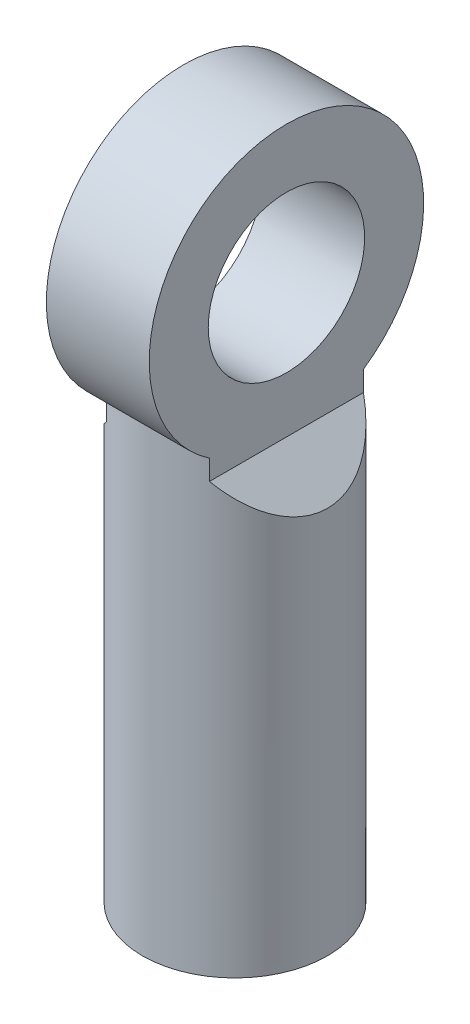
ISO-10303-21;
HEADER;
FILE_DESCRIPTION(('STEP AP214'),'2;1');
FILE_NAME('part.step','',(''),(''),'','','');
FILE_SCHEMA(('AUTOMOTIVE_DESIGN { 1 0 10303 214 1 1 1 1 }'));
ENDSEC;
DATA;
#1=APPLICATION_CONTEXT('core data for automotive mechanical design processes');
#2=APPLICATION_PROTOCOL_DEFINITION('international standard','automotive_design',2000,#1);
#3=PRODUCT_CONTEXT('',#1,'mechanical');
#4=PRODUCT('Part','Part','',(#3));
#5=PRODUCT_RELATED_PRODUCT_CATEGORY('part','',(#4));
#6=PRODUCT_DEFINITION_FORMATION('','',#4);
#7=PRODUCT_DEFINITION_CONTEXT('part definition',#1,'design');
#8=PRODUCT_DEFINITION('design','',#6,#7);
#9=PRODUCT_DEFINITION_SHAPE('','',#8);
#10=(LENGTH_UNIT() NAMED_UNIT(*) SI_UNIT(.MILLI.,.METRE.));
#11=(NAMED_UNIT(*) PLANE_ANGLE_UNIT() SI_UNIT($,.RADIAN.));
#12=(NAMED_UNIT(*) SI_UNIT($,.STERADIAN.) SOLID_ANGLE_UNIT());
#13=UNCERTAINTY_MEASURE_WITH_UNIT(LENGTH_MEASURE(1.E-05),#10,'distance_accuracy_value','');
#14=(GEOMETRIC_REPRESENTATION_CONTEXT(3) GLOBAL_UNCERTAINTY_ASSIGNED_CONTEXT((#13)) GLOBAL_UNIT_ASSIGNED_CONTEXT((#10,
#11,#12)) REPRESENTATION_CONTEXT('',''));
#15=CARTESIAN_POINT('',(0.,0.,0.));
#16=DIRECTION('',(0.,0.,1.));
#17=DIRECTION('',(1.,0.,0.));
#18=AXIS2_PLACEMENT_3D('',#15,#16,#17);
#19=CARTESIAN_POINT('',(0.,24.384,0.));
#20=DIRECTION('',(0.,-1.,0.));
#21=DIRECTION('',(0.,0.,-1.));
#22=AXIS2_PLACEMENT_3D('',#19,#20,#21);
#23=CYLINDRICAL_SURFACE('',#22,3.429);
#24=CARTESIAN_POINT('',(0.,0.,0.));
#25=DIRECTION('',(0.,1.,0.));
#26=DIRECTION('',(0.,0.,1.));
#27=AXIS2_PLACEMENT_3D('',#24,#25,#26);
#28=CIRCLE('',#27,3.429);
#29=CARTESIAN_POINT('',(0.,0.,3.429));
#30=VERTEX_POINT('',#29);
#31=EDGE_CURVE('E136',#30,#30,#28,.T.);
#32=ORIENTED_EDGE('',*,*,#31,.T.);
#33=EDGE_LOOP('',(#32));
#34=FACE_BOUND('',#33,.T.);
#35=CARTESIAN_POINT('',(0.,17.0798859409031,-3.429));
#36=CARTESIAN_POINT('',(-0.0833685074832233,17.0798858060849,-3.42899998442887));
#37=CARTESIAN_POINT('',(-0.166741147940647,17.0770918340976,-3.42595336744427));
#38=CARTESIAN_POINT('',(-0.332684930631039,17.0660616736041,-3.41383738905543));
#39=CARTESIAN_POINT('',(-0.41525597360773,17.0578248196494,-3.40476729121756));
#40=CARTESIAN_POINT('',(-0.578981594197905,17.0363007879698,-3.38078026733486));
#41=CARTESIAN_POINT('',(-0.660134166691902,17.0230069842865,-3.3658556695229));
#42=CARTESIAN_POINT('',(-0.820359272814698,16.991965806128,-3.33043458594731));
#43=CARTESIAN_POINT('',(-0.899430706409005,16.9742161266307,-3.30993521589847));
#44=CARTESIAN_POINT('',(-1.13119821787466,16.9157365593828,-3.24101815037118));
#45=CARTESIAN_POINT('',(-1.28028424948475,16.8695070512019,-3.18490130614518));
#46=CARTESIAN_POINT('',(-1.56656693814464,16.7678897254098,-3.05429754784925));
#47=CARTESIAN_POINT('',(-1.70376149121341,16.7125002921372,-2.97980739188551));
#48=CARTESIAN_POINT('',(-1.98656726351258,16.5881656716799,-2.80069896693761));
#49=CARTESIAN_POINT('',(-2.13000314419142,16.5184706905612,-2.69316541361507));
#50=CARTESIAN_POINT('',(-2.39876539808643,16.3794941116549,-2.45682676821383));
#51=CARTESIAN_POINT('',(-2.52407142019764,16.3102130608402,-2.32799811410505));
#52=CARTESIAN_POINT('',(-2.7053359293217,16.2058470030963,-2.10949139861423));
#53=CARTESIAN_POINT('',(-2.76816040459175,16.1687248283845,-2.02639343446406));
#54=CARTESIAN_POINT('',(-2.88648660028624,16.0974685306546,-1.85395851542749));
#55=CARTESIAN_POINT('',(-2.94199157782492,16.0633330808604,-1.76462436284229));
#56=CARTESIAN_POINT('',(-3.04500275888648,15.9990473111332,-1.58023181389675));
#57=CARTESIAN_POINT('',(-3.09251841605927,15.9688922904316,-1.48518036623931));
#58=CARTESIAN_POINT('',(-3.17891853531626,15.9134514115114,-1.28993090320555));
#59=CARTESIAN_POINT('',(-3.21780640252334,15.8881636328661,-1.18973493750707));
#60=CARTESIAN_POINT('',(-3.30312306572156,15.8322548323188,-0.934511183730478));
#61=CARTESIAN_POINT('',(-3.34386487108065,15.8051207918234,-0.776736878514408));
#62=CARTESIAN_POINT('',(-3.40256115342979,15.76585565311,-0.455293928646331));
#63=CARTESIAN_POINT('',(-3.42053298174522,15.7537131311385,-0.291629870071383));
#64=CARTESIAN_POINT('',(-3.43274879404838,15.7454710740521,0.0372818258191978));
#65=CARTESIAN_POINT('',(-3.42695369747785,15.7493979622532,0.202531625226222));
#66=CARTESIAN_POINT('',(-3.39187898771061,15.7729987697789,0.529373303551176));
#67=CARTESIAN_POINT('',(-3.36259244294595,15.792677336912,0.69096408833959));
#68=CARTESIAN_POINT('',(-3.28282675810848,15.845586797706,1.00331301879068));
#69=CARTESIAN_POINT('',(-3.23272824654401,15.8785739933011,1.15421143211392));
#70=CARTESIAN_POINT('',(-3.11353793865218,15.9555865407503,1.44522495242352));
#71=CARTESIAN_POINT('',(-3.04444254527492,15.9996139829305,1.58533801077078));
#72=CARTESIAN_POINT('',(-2.8807098918509,16.1012399032085,1.86792691186462));
#73=CARTESIAN_POINT('',(-2.78407139867111,16.1598087288367,2.00888864564534));
#74=CARTESIAN_POINT('',(-2.57248621709049,16.2828235106747,2.27357029874929));
#75=CARTESIAN_POINT('',(-2.45751816665401,16.347276286359,2.39726978052882));
#76=CARTESIAN_POINT('',(-2.19052957182794,16.4884370752746,2.64540976519641));
#77=CARTESIAN_POINT('',(-2.03552789422261,16.565392230355,2.76651559657206));
#78=CARTESIAN_POINT('',(-1.70495689880312,16.7129790804495,2.98160910335613));
#79=CARTESIAN_POINT('',(-1.52939993872615,16.7836145302317,3.07561295582998));
#80=CARTESIAN_POINT('',(-1.20357742299947,16.8936104548705,3.21448191422285));
#81=CARTESIAN_POINT('',(-1.05720679705724,16.936414489573,3.26571500031337));
#82=CARTESIAN_POINT('',(-0.75563721008462,17.0072681540424,3.3483428220456));
#83=CARTESIAN_POINT('',(-0.60045484442543,17.0353445620373,3.37977358396616));
#84=CARTESIAN_POINT('',(-0.283604759150127,17.0724770094032,3.42100603216829));
#85=CARTESIAN_POINT('',(-0.121895568420713,17.0813814129329,3.43063531607674));
#86=CARTESIAN_POINT('',(0.201040572868871,17.0779726749585,3.42690798076458));
#87=CARTESIAN_POINT('',(0.362267490918211,17.0656581339605,3.41354984541058));
#88=CARTESIAN_POINT('',(0.661425823499576,17.0245550527129,3.36763730457841));
#89=CARTESIAN_POINT('',(0.799989663400524,16.9976942009183,3.33731751390665));
#90=CARTESIAN_POINT('',(1.06982903586948,16.9323975732253,3.26085966449098));
#91=CARTESIAN_POINT('',(1.20109785797982,16.8939513424115,3.21470731284692));
#92=CARTESIAN_POINT('',(1.51190992006733,16.7901660207657,3.08414836618109));
#93=CARTESIAN_POINT('',(1.68670585418811,16.720498302888,2.99186809236919));
#94=CARTESIAN_POINT('',(2.01630572463553,16.5745370052542,2.78046848511011));
#95=CARTESIAN_POINT('',(2.17107219339015,16.4982314418449,2.66129996399573));
#96=CARTESIAN_POINT('',(2.46059122889498,16.3460864993438,2.39635401561446));
#97=CARTESIAN_POINT('',(2.59505305974586,16.2702665267581,2.25024651796202));
#98=CARTESIAN_POINT('',(2.83827500687003,16.127521452303,1.93438135820587));
#99=CARTESIAN_POINT('',(2.94707613487195,16.0605822328982,1.76466213298471));
#100=CARTESIAN_POINT('',(3.11801981979161,15.9528743424748,1.43660178981901));
#101=CARTESIAN_POINT('',(3.18502370979182,15.909567229578,1.28163371246739));
#102=CARTESIAN_POINT('',(3.29608398173576,15.8369326354213,0.960554317489945));
#103=CARTESIAN_POINT('',(3.34015513723274,15.8075961551417,0.794450251866528));
#104=CARTESIAN_POINT('',(3.40313804173787,15.765475756307,0.454614018057552));
#105=CARTESIAN_POINT('',(3.42193244876895,15.7527690452309,0.280850114149151));
#106=CARTESIAN_POINT('',(3.43276023807727,15.7454630979483,-0.067889609537704));
#107=CARTESIAN_POINT('',(3.42479841240746,15.7508606192657,-0.242865206699841));
#108=CARTESIAN_POINT('',(3.3843166840183,15.7780726547744,-0.574625769290895));
#109=CARTESIAN_POINT('',(3.35375617179691,15.7985768682977,-0.731766663182168));
#110=CARTESIAN_POINT('',(3.27192362853354,15.8527707730477,-1.03812914984899));
#111=CARTESIAN_POINT('',(3.22064828927559,15.8864625703416,-1.18734947337862));
#112=CARTESIAN_POINT('',(3.09625821890261,15.9666430902823,-1.48265569724507));
#113=CARTESIAN_POINT('',(3.02212246280541,16.0137196657838,-1.62814752354157));
#114=CARTESIAN_POINT('',(2.85570429918948,16.1164059152281,-1.90502620477143));
#115=CARTESIAN_POINT('',(2.76341183948118,16.1720203122457,-2.03640518376082));
#116=CARTESIAN_POINT('',(2.54689582107363,16.2974337442574,-2.30334543038858));
#117=CARTESIAN_POINT('',(2.41993070405486,16.3680850587929,-2.43628186906184));
#118=CARTESIAN_POINT('',(2.14666448950547,16.510259923123,-2.68019860069472));
#119=CARTESIAN_POINT('',(2.00034734582436,16.5817841515455,-2.79116048019197));
#120=CARTESIAN_POINT('',(1.69883821430654,16.7149488399295,-2.98363856337612));
#121=CARTESIAN_POINT('',(1.54464764830292,16.7769216077398,-3.06648578513813));
#122=CARTESIAN_POINT('',(1.22178629606702,16.8886721188634,-3.20878373221549));
#123=CARTESIAN_POINT('',(1.05314132600014,16.9384710165259,-3.26827515317422));
#124=CARTESIAN_POINT('',(0.737516292075622,17.0104691146867,-3.35191665259587));
#125=CARTESIAN_POINT('',(0.592582959440336,17.0361295932378,-3.38065611565295));
#126=CARTESIAN_POINT('',(0.371995624235096,17.0621849962633,-3.40957239162504));
#127=CARTESIAN_POINT('',(0.297937736677733,17.0687975653391,-3.41684565809843));
#128=CARTESIAN_POINT('',(0.149254213105864,17.0776474120702,-3.42655871149062));
#129=CARTESIAN_POINT('',(0.0746287624796964,17.0798860615879,-3.42900001393876));
#130=CARTESIAN_POINT('',(0.,17.0798859409031,-3.429));
#131=B_SPLINE_CURVE_WITH_KNOTS('',3,(#35,#36,#37,#38,#39,#40,#41,#42,#43,#44,#45,#46,#47,#48,
#49,#50,#51,#52,#53,#54,#55,#56,#57,#58,#59,#60,#61,#62,#63,#64,#65,#66,#67,#68,#69,#70,#71,#72,
#73,#74,#75,#76,#77,#78,#79,#80,#81,#82,#83,#84,#85,#86,#87,#88,#89,#90,#91,#92,#93,#94,#95,#96,
#97,#98,#99,#100,#101,#102,#103,#104,#105,#106,#107,#108,#109,#110,#111,#112,#113,#114,#115,
#116,#117,#118,#119,#120,#121,#122,#123,#124,#125,#126,#127,#128,#129,#130),.UNSPECIFIED.,.T.,
.F.,(4,2,2,2,2,2,2,2,2,2,2,2,2,2,2,2,2,2,2,2,2,2,2,2,2,2,2,2,2,2,2,2,2,2,2,2,2,2,2,2,2,2,2,2,2,
2,2,4),(0.,0.250011985609109,0.500054543430601,0.750425858790674,1.00092695894962,
1.49636986526057,1.99190025300909,2.56685254933574,3.14244531476325,3.47382548802032,
3.80505769870576,4.13589516580699,4.46660182835838,4.95984141267564,5.45270490886314,
5.94637915767233,6.44019912742249,6.9253597099025,7.41061222063464,7.95056561139307,
8.49115294950772,9.12213244288562,9.75273452359684,10.2335780701214,10.7135442746978,
11.1972929076302,11.6810734473876,12.1124828360356,12.5442827103955,13.169703572181,
13.7962779513696,14.4311123444653,15.0649251439232,15.5856487828732,16.1060365485654,
16.6288318610179,17.1515335455927,17.6335572780868,18.1156580215733,18.6235328893288,
19.1316897297966,19.7202154192051,20.3092321930495,20.8642121648209,21.4182207896799,
21.8659953215376,22.0898681059385,22.3136706622557),.UNSPECIFIED.);
#132=CARTESIAN_POINT('',(-1.905,16.6235518792593,2.85114292872174));
#133=VERTEX_POINT('',#132);
#134=CARTESIAN_POINT('',(1.905,16.6235518792593,2.85114292872174));
#135=VERTEX_POINT('',#134);
#136=EDGE_CURVE('E102',#133,#135,#131,.T.);
#137=ORIENTED_EDGE('',*,*,#136,.F.);
#138=DIRECTION('',(0.,-1.,0.));
#139=VECTOR('',#138,1.);
#140=CARTESIAN_POINT('',(-1.905,24.384,2.85114292872174));
#141=LINE('',#140,#139);
#142=CARTESIAN_POINT('',(-1.905,15.875,2.85114292872174));
#143=VERTEX_POINT('',#142);
#144=EDGE_CURVE('E137',#133,#143,#141,.T.);
#145=ORIENTED_EDGE('',*,*,#144,.T.);
#146=CARTESIAN_POINT('',(0.,17.78,0.));
#147=DIRECTION('',(0.707106781186551,-0.707106781186544,0.));
#148=DIRECTION('',(-0.707106781186544,-0.707106781186551,0.));
#149=AXIS2_PLACEMENT_3D('',#146,#147,#148);
#150=ELLIPSE('',#149,4.84933830537737,3.429);
#151=CARTESIAN_POINT('',(-1.905,15.875,-2.85114292872174));
#152=VERTEX_POINT('',#151);
#153=EDGE_CURVE('E40',#143,#152,#150,.T.);
#154=ORIENTED_EDGE('',*,*,#153,.T.);
#155=DIRECTION('',(0.,-1.,0.));
#156=VECTOR('',#155,1.);
#157=CARTESIAN_POINT('',(-1.905,24.384,-2.85114292872174));
#158=LINE('',#157,#156);
#159=CARTESIAN_POINT('',(-1.905,16.6235518792593,-2.85114292872174));
#160=VERTEX_POINT('',#159);
#161=EDGE_CURVE('E52',#152,#160,#158,.F.);
#162=ORIENTED_EDGE('',*,*,#161,.T.);
#163=CARTESIAN_POINT('',(1.905,16.6235518792593,-2.85114292872174));
#164=VERTEX_POINT('',#163);
#165=EDGE_CURVE('E96',#164,#160,#131,.T.);
#166=ORIENTED_EDGE('',*,*,#165,.F.);
#167=DIRECTION('',(0.,-1.,0.));
#168=VECTOR('',#167,1.);
#169=CARTESIAN_POINT('',(1.905,24.384,-2.85114292872174));
#170=LINE('',#169,#168);
#171=CARTESIAN_POINT('',(1.905,15.875,-2.85114292872174));
#172=VERTEX_POINT('',#171);
#173=EDGE_CURVE('E144',#164,#172,#170,.T.);
#174=ORIENTED_EDGE('',*,*,#173,.T.);
#175=CARTESIAN_POINT('',(0.,17.78,0.));
#176=DIRECTION('',(-0.707106781186551,-0.707106781186544,0.));
#177=DIRECTION('',(0.707106781186544,-0.707106781186551,0.));
#178=AXIS2_PLACEMENT_3D('',#175,#176,#177);
#179=ELLIPSE('',#178,4.84933830537737,3.429);
#180=CARTESIAN_POINT('',(1.905,15.875,2.85114292872174));
#181=VERTEX_POINT('',#180);
#182=EDGE_CURVE('E11',#172,#181,#179,.T.);
#183=ORIENTED_EDGE('',*,*,#182,.T.);
#184=DIRECTION('',(0.,-1.,0.));
#185=VECTOR('',#184,1.);
#186=CARTESIAN_POINT('',(1.905,24.384,2.85114292872174));
#187=LINE('',#186,#185);
#188=EDGE_CURVE('E145',#181,#135,#187,.F.);
#189=ORIENTED_EDGE('',*,*,#188,.T.);
#190=EDGE_LOOP('',(#137,#145,#154,#162,#166,#174,#183,#189));
#191=FACE_BOUND('',#190,.T.);
#192=ADVANCED_FACE('F32',(#34,#191),#23,.T.);
#193=CARTESIAN_POINT('',(0.,0.,0.));
#194=DIRECTION('',(0.,1.,0.));
#195=DIRECTION('',(0.,0.,1.));
#196=AXIS2_PLACEMENT_3D('',#193,#194,#195);
#197=PLANE('',#196);
#198=CARTESIAN_POINT('',(0.,0.,0.));
#199=DIRECTION('',(0.,-1.,0.));
#200=DIRECTION('',(0.,0.,-1.));
#201=AXIS2_PLACEMENT_3D('',#198,#199,#200);
#202=CIRCLE('',#201,2.49999999999999);
#203=CARTESIAN_POINT('',(0.,0.,-2.49999999999999));
#204=VERTEX_POINT('',#203);
#205=EDGE_CURVE('E85',#204,#204,#202,.T.);
#206=ORIENTED_EDGE('',*,*,#205,.F.);
#207=EDGE_LOOP('',(#206));
#208=FACE_BOUND('',#207,.T.);
#209=ORIENTED_EDGE('',*,*,#31,.F.);
#210=EDGE_LOOP('',(#209));
#211=FACE_BOUND('',#210,.T.);
#212=ADVANCED_FACE('F124',(#208,#211),#197,.F.);
#213=CARTESIAN_POINT('',(-1.905,15.875,-3.429));
#214=DIRECTION('',(0.707106781186551,-0.707106781186544,0.));
#215=DIRECTION('',(0.707106781186544,0.707106781186551,0.));
#216=AXIS2_PLACEMENT_3D('',#213,#214,#215);
#217=PLANE('',#216);
#218=DIRECTION('',(0.,0.,1.));
#219=VECTOR('',#218,1.);
#220=CARTESIAN_POINT('',(-1.905,15.875,-3.429));
#221=LINE('',#220,#219);
#222=EDGE_CURVE('E47',#152,#143,#221,.T.);
#223=ORIENTED_EDGE('',*,*,#222,.F.);
#224=ORIENTED_EDGE('',*,*,#153,.F.);
#225=EDGE_LOOP('',(#223,#224));
#226=FACE_BOUND('',#225,.T.);
#227=ADVANCED_FACE('F121',(#226),#217,.F.);
#228=CARTESIAN_POINT('',(-1.905,15.875,-3.429));
#229=DIRECTION('',(1.,0.,0.));
#230=DIRECTION('',(0.,0.,-1.));
#231=AXIS2_PLACEMENT_3D('',#228,#229,#230);
#232=PLANE('',#231);
#233=CARTESIAN_POINT('',(-1.905,20.828,0.));
#234=DIRECTION('',(-1.,0.,0.));
#235=DIRECTION('',(0.,0.,1.));
#236=AXIS2_PLACEMENT_3D('',#233,#234,#235);
#237=CIRCLE('',#236,2.8956);
#238=CARTESIAN_POINT('',(-1.905,20.828,2.8956));
#239=VERTEX_POINT('',#238);
#240=EDGE_CURVE('E169',#239,#239,#237,.T.);
#241=ORIENTED_EDGE('',*,*,#240,.F.);
#242=EDGE_LOOP('',(#241));
#243=FACE_BOUND('',#242,.T.);
#244=ORIENTED_EDGE('',*,*,#144,.F.);
#245=CARTESIAN_POINT('',(-1.905,20.828,0.));
#246=DIRECTION('',(1.,0.,0.));
#247=DIRECTION('',(0.,0.,-1.));
#248=AXIS2_PLACEMENT_3D('',#245,#246,#247);
#249=CIRCLE('',#248,5.08);
#250=EDGE_CURVE('E88',#160,#133,#249,.T.);
#251=ORIENTED_EDGE('',*,*,#250,.F.);
#252=ORIENTED_EDGE('',*,*,#161,.F.);
#253=ORIENTED_EDGE('',*,*,#222,.T.);
#254=EDGE_LOOP('',(#244,#251,#252,#253));
#255=FACE_BOUND('',#254,.T.);
#256=ADVANCED_FACE('F114',(#243,#255),#232,.F.);
#257=CARTESIAN_POINT('',(1.905,15.875,-3.429));
#258=DIRECTION('',(-0.707106781186551,-0.707106781186544,0.));
#259=DIRECTION('',(0.707106781186544,-0.707106781186551,0.));
#260=AXIS2_PLACEMENT_3D('',#257,#258,#259);
#261=PLANE('',#260);
#262=DIRECTION('',(0.,0.,1.));
#263=VECTOR('',#262,1.);
#264=CARTESIAN_POINT('',(1.905,15.875,-3.429));
#265=LINE('',#264,#263);
#266=EDGE_CURVE('E103',#172,#181,#265,.T.);
#267=ORIENTED_EDGE('',*,*,#266,.T.);
#268=ORIENTED_EDGE('',*,*,#182,.F.);
#269=EDGE_LOOP('',(#267,#268));
#270=FACE_BOUND('',#269,.T.);
#271=ADVANCED_FACE('F111',(#270),#261,.F.);
#272=CARTESIAN_POINT('',(1.905,15.875,-3.429));
#273=DIRECTION('',(-1.,0.,0.));
#274=DIRECTION('',(0.,0.,1.));
#275=AXIS2_PLACEMENT_3D('',#272,#273,#274);
#276=PLANE('',#275);
#277=CARTESIAN_POINT('',(1.905,20.828,0.));
#278=DIRECTION('',(-1.,0.,0.));
#279=DIRECTION('',(0.,0.,1.));
#280=AXIS2_PLACEMENT_3D('',#277,#278,#279);
#281=CIRCLE('',#280,2.8956);
#282=CARTESIAN_POINT('',(1.905,20.828,2.8956));
#283=VERTEX_POINT('',#282);
#284=EDGE_CURVE('E91',#283,#283,#281,.T.);
#285=ORIENTED_EDGE('',*,*,#284,.T.);
#286=EDGE_LOOP('',(#285));
#287=FACE_BOUND('',#286,.T.);
#288=ORIENTED_EDGE('',*,*,#173,.F.);
#289=CARTESIAN_POINT('',(1.905,20.828,0.));
#290=DIRECTION('',(-1.,0.,0.));
#291=DIRECTION('',(0.,0.,1.));
#292=AXIS2_PLACEMENT_3D('',#289,#290,#291);
#293=CIRCLE('',#292,5.08);
#294=EDGE_CURVE('E84',#164,#135,#293,.F.);
#295=ORIENTED_EDGE('',*,*,#294,.T.);
#296=ORIENTED_EDGE('',*,*,#188,.F.);
#297=ORIENTED_EDGE('',*,*,#266,.F.);
#298=EDGE_LOOP('',(#288,#295,#296,#297));
#299=FACE_BOUND('',#298,.T.);
#300=ADVANCED_FACE('F108',(#287,#299),#276,.F.);
#301=CARTESIAN_POINT('',(-16.2734097937106,20.828,0.));
#302=DIRECTION('',(1.,0.,0.));
#303=DIRECTION('',(0.,0.,-1.));
#304=AXIS2_PLACEMENT_3D('',#301,#302,#303);
#305=CYLINDRICAL_SURFACE('',#304,5.08);
#306=ORIENTED_EDGE('',*,*,#250,.T.);
#307=ORIENTED_EDGE('',*,*,#136,.T.);
#308=ORIENTED_EDGE('',*,*,#294,.F.);
#309=ORIENTED_EDGE('',*,*,#165,.T.);
#310=EDGE_LOOP('',(#306,#307,#308,#309));
#311=FACE_BOUND('',#310,.T.);
#312=ADVANCED_FACE('F78',(#311),#305,.T.);
#313=CARTESIAN_POINT('',(0.,14.986,0.));
#314=DIRECTION('',(0.,-1.,0.));
#315=DIRECTION('',(0.,0.,-1.));
#316=AXIS2_PLACEMENT_3D('',#313,#314,#315);
#317=CONICAL_SURFACE('',#316,2.49999999999999,1.02974425867665);
#318=CARTESIAN_POINT('',(0.,16.4881515475689,0.));
#319=VERTEX_POINT('',#318);
#320=VERTEX_LOOP('',#319);
#321=FACE_BOUND('',#320,.T.);
#322=CARTESIAN_POINT('',(0.,14.986,0.));
#323=DIRECTION('',(0.,-1.,0.));
#324=DIRECTION('',(0.,0.,-1.));
#325=AXIS2_PLACEMENT_3D('',#322,#323,#324);
#326=CIRCLE('',#325,2.49999999999999);
#327=CARTESIAN_POINT('',(0.,14.986,-2.49999999999999));
#328=VERTEX_POINT('',#327);
#329=EDGE_CURVE('E82',#328,#328,#326,.T.);
#330=ORIENTED_EDGE('',*,*,#329,.T.);
#331=EDGE_LOOP('',(#330));
#332=FACE_BOUND('',#331,.T.);
#333=ADVANCED_FACE('F74',(#321,#332),#317,.F.);
#334=CARTESIAN_POINT('',(0.,0.,0.));
#335=DIRECTION('',(0.,-1.,0.));
#336=DIRECTION('',(0.,0.,-1.));
#337=AXIS2_PLACEMENT_3D('',#334,#335,#336);
#338=CYLINDRICAL_SURFACE('',#337,2.49999999999999);
#339=ORIENTED_EDGE('',*,*,#329,.F.);
#340=EDGE_LOOP('',(#339));
#341=FACE_BOUND('',#340,.T.);
#342=ORIENTED_EDGE('',*,*,#205,.T.);
#343=EDGE_LOOP('',(#342));
#344=FACE_BOUND('',#343,.T.);
#345=ADVANCED_FACE('F77',(#341,#344),#338,.F.);
#346=CARTESIAN_POINT('',(-1.905,20.828,0.));
#347=DIRECTION('',(-1.,0.,0.));
#348=DIRECTION('',(0.,0.,1.));
#349=AXIS2_PLACEMENT_3D('',#346,#347,#348);
#350=CYLINDRICAL_SURFACE('',#349,2.8956);
#351=ORIENTED_EDGE('',*,*,#240,.T.);
#352=EDGE_LOOP('',(#351));
#353=FACE_BOUND('',#352,.T.);
#354=ORIENTED_EDGE('',*,*,#284,.F.);
#355=EDGE_LOOP('',(#354));
#356=FACE_BOUND('',#355,.T.);
#357=ADVANCED_FACE('F158',(#353,#356),#350,.F.);
#358=CLOSED_SHELL('',(#192,#212,#227,#256,#271,#300,#312,#333,#345,#357));
#359=MANIFOLD_SOLID_BREP('B2',#358);
#360=ADVANCED_BREP_SHAPE_REPRESENTATION('',(#18,#359),#14);
#361=SHAPE_DEFINITION_REPRESENTATION(#9,#360);
ENDSEC;
END-ISO-10303-21;
